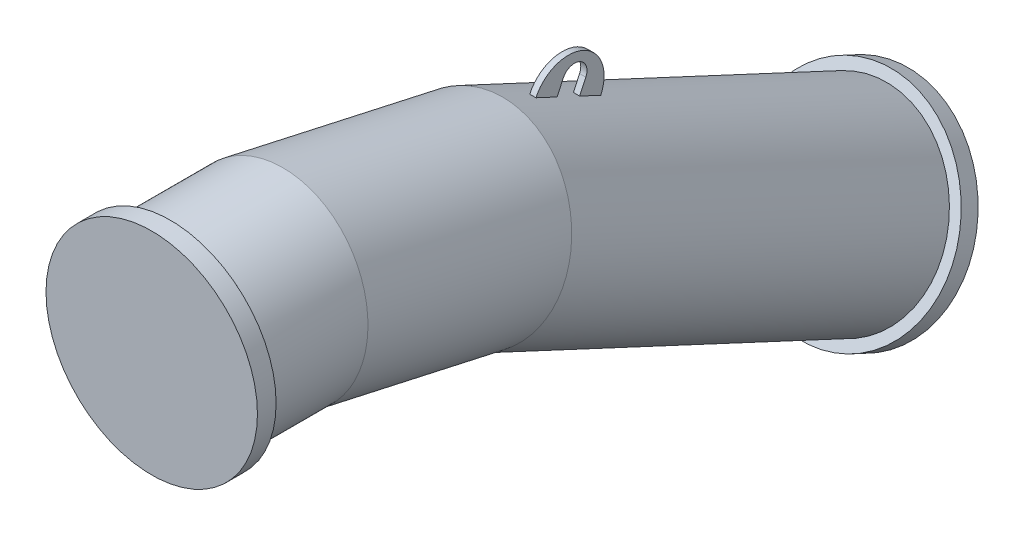
ISO-10303-21;
HEADER;
FILE_DESCRIPTION(('STEP AP214'),'2;1');
FILE_NAME('part.step','',(''),(''),'','','');
FILE_SCHEMA(('AUTOMOTIVE_DESIGN { 1 0 10303 214 1 1 1 1 }'));
ENDSEC;
DATA;
#1=APPLICATION_CONTEXT('core data for automotive mechanical design processes');
#2=APPLICATION_PROTOCOL_DEFINITION('international standard','automotive_design',2000,#1);
#3=PRODUCT_CONTEXT('',#1,'mechanical');
#4=PRODUCT('Part','Part','',(#3));
#5=PRODUCT_RELATED_PRODUCT_CATEGORY('part','',(#4));
#6=PRODUCT_DEFINITION_FORMATION('','',#4);
#7=PRODUCT_DEFINITION_CONTEXT('part definition',#1,'design');
#8=PRODUCT_DEFINITION('design','',#6,#7);
#9=PRODUCT_DEFINITION_SHAPE('','',#8);
#10=(LENGTH_UNIT() NAMED_UNIT(*) SI_UNIT(.MILLI.,.METRE.));
#11=(NAMED_UNIT(*) PLANE_ANGLE_UNIT() SI_UNIT($,.RADIAN.));
#12=(NAMED_UNIT(*) SI_UNIT($,.STERADIAN.) SOLID_ANGLE_UNIT());
#13=UNCERTAINTY_MEASURE_WITH_UNIT(LENGTH_MEASURE(1.E-05),#10,'distance_accuracy_value','');
#14=(GEOMETRIC_REPRESENTATION_CONTEXT(3) GLOBAL_UNCERTAINTY_ASSIGNED_CONTEXT((#13)) GLOBAL_UNIT_ASSIGNED_CONTEXT((#10,
#11,#12)) REPRESENTATION_CONTEXT('',''));
#15=CARTESIAN_POINT('',(0.,0.,0.));
#16=DIRECTION('',(0.,0.,1.));
#17=DIRECTION('',(1.,0.,0.));
#18=AXIS2_PLACEMENT_3D('',#15,#16,#17);
#19=CARTESIAN_POINT('',(0.,-71.1119786402001,-485.042124289447));
#20=DIRECTION('',(0.,0.216439613938103,0.976296007119933));
#21=DIRECTION('',(0.,-0.976296007119933,0.216439613938103));
#22=AXIS2_PLACEMENT_3D('',#19,#20,#21);
#23=CYLINDRICAL_SURFACE('',#22,152.5);
#24=CARTESIAN_POINT('',(0.,-71.1119786402001,-485.042124289447));
#25=DIRECTION('',(0.,-0.321439465303161,-0.946930129495106));
#26=DIRECTION('',(0.,-0.946930129495106,0.321439465303161));
#27=AXIS2_PLACEMENT_3D('',#24,#25,#26);
#28=ELLIPSE('',#27,153.411828018437,152.5);
#29=CARTESIAN_POINT('',(0.,-216.38226081178,-435.72950832002));
#30=VERTEX_POINT('',#29);
#31=EDGE_CURVE('E329',#30,#30,#28,.T.);
#32=ORIENTED_EDGE('',*,*,#31,.F.);
#33=EDGE_LOOP('',(#32));
#34=FACE_BOUND('',#33,.T.);
#35=CARTESIAN_POINT('',(0.,0.,-164.276717524863));
#36=DIRECTION('',(0.,-0.108866874851965,-0.99405633822232));
#37=DIRECTION('',(0.,-0.99405633822232,0.108866874851965));
#38=AXIS2_PLACEMENT_3D('',#35,#36,#37);
#39=ELLIPSE('',#38,153.411828018437,152.5);
#40=CARTESIAN_POINT('',(0.,-152.5,-147.575251243168));
#41=VERTEX_POINT('',#40);
#42=EDGE_CURVE('E10',#41,#41,#39,.T.);
#43=ORIENTED_EDGE('',*,*,#42,.T.);
#44=EDGE_LOOP('',(#43));
#45=FACE_BOUND('',#44,.T.);
#46=ADVANCED_FACE('F17',(#34,#45),#23,.T.);
#47=CARTESIAN_POINT('',(0.,-351.847450315372,-1087.08128612937));
#48=DIRECTION('',(0.,0.422618261740698,0.906307787036651));
#49=DIRECTION('',(0.,-0.906307787036651,0.422618261740698));
#50=AXIS2_PLACEMENT_3D('',#47,#48,#49);
#51=CYLINDRICAL_SURFACE('',#50,152.5);
#52=CARTESIAN_POINT('',(4.99999999999999,2.88206355500217,-687.013127055303));
#53=CARTESIAN_POINT('',(3.33333333333333,2.93158541821618,-687.036262477466));
#54=CARTESIAN_POINT('',(1.66666666666667,2.95634634982318,-687.047830188548));
#55=CARTESIAN_POINT('',(-1.66666666666665,2.95634634982318,-687.047830188548));
#56=CARTESIAN_POINT('',(-3.33333333333331,2.93158541821617,-687.036262477466));
#57=CARTESIAN_POINT('',(-4.99999999999998,2.88206355500216,-687.013127055303));
#58=B_SPLINE_CURVE_WITH_KNOTS('',3,(#52,#53,#54,#55,#56,#57),.UNSPECIFIED.,.F.,.F.,(4,2,4),(0.,
5.00067217892388,10.0013443578478),.UNSPECIFIED.);
#59=CARTESIAN_POINT('',(4.99999999999999,2.88206355500217,-687.013127055303));
#60=VERTEX_POINT('',#59);
#61=CARTESIAN_POINT('',(-5.,2.88206355500202,-687.013127055303));
#62=VERTEX_POINT('',#61);
#63=EDGE_CURVE('E46',#60,#62,#58,.T.);
#64=ORIENTED_EDGE('',*,*,#63,.F.);
#65=DIRECTION('',(0.,0.422618261740698,0.906307787036651));
#66=VECTOR('',#65,1.);
#67=CARTESIAN_POINT('',(5.00000000000004,-213.709820290946,-1151.49592088914));
#68=LINE('',#67,#66);
#69=CARTESIAN_POINT('',(5.00000000000002,18.7302236664366,-653.026638018989));
#70=VERTEX_POINT('',#69);
#71=EDGE_CURVE('E39',#60,#70,#68,.T.);
#72=ORIENTED_EDGE('',*,*,#71,.T.);
#73=CARTESIAN_POINT('',(0.,-119.40740635799,-588.612003259217));
#74=DIRECTION('',(0.,-0.422618261740697,-0.906307787036651));
#75=DIRECTION('',(0.,0.906307787036651,-0.422618261740697));
#76=AXIS2_PLACEMENT_3D('',#73,#74,#75);
#77=CIRCLE('',#76,152.5);
#78=CARTESIAN_POINT('',(-4.99999999999996,18.7302236664361,-653.026638018989));
#79=VERTEX_POINT('',#78);
#80=EDGE_CURVE('E325',#79,#70,#77,.T.);
#81=ORIENTED_EDGE('',*,*,#80,.F.);
#82=DIRECTION('',(0.,0.422618261740698,0.906307787036651));
#83=VECTOR('',#82,1.);
#84=CARTESIAN_POINT('',(-4.99999999999992,-213.709820290946,-1151.49592088914));
#85=LINE('',#84,#83);
#86=EDGE_CURVE('E293',#62,#79,#85,.T.);
#87=ORIENTED_EDGE('',*,*,#86,.F.);
#88=EDGE_LOOP('',(#64,#72,#81,#87));
#89=FACE_BOUND('',#88,.T.);
#90=CARTESIAN_POINT('',(0.,-102.502675888362,-552.359691777751));
#91=DIRECTION('',(0.,0.422618261740698,0.906307787036652));
#92=DIRECTION('',(0.,-0.906307787036651,0.422618261740697));
#93=AXIS2_PLACEMENT_3D('',#90,#91,#92);
#94=CIRCLE('',#93,152.5);
#95=CARTESIAN_POINT('',(5.00000000000002,35.6349541360645,-616.774326537523));
#96=VERTEX_POINT('',#95);
#97=CARTESIAN_POINT('',(-4.99999999999996,35.6349541360641,-616.774326537523));
#98=VERTEX_POINT('',#97);
#99=EDGE_CURVE('E302',#96,#98,#94,.T.);
#100=ORIENTED_EDGE('',*,*,#99,.F.);
#101=CARTESIAN_POINT('',(4.99999999999999,51.4831142474984,-582.787837501208));
#102=VERTEX_POINT('',#101);
#103=EDGE_CURVE('E326',#96,#102,#68,.T.);
#104=ORIENTED_EDGE('',*,*,#103,.T.);
#105=CARTESIAN_POINT('',(-4.99999999999998,51.4831142474984,-582.787837501208));
#106=CARTESIAN_POINT('',(-3.33333333333332,51.5326690491684,-582.810902286625));
#107=CARTESIAN_POINT('',(-1.66666666666666,51.5574464500035,-582.822434679333));
#108=CARTESIAN_POINT('',(1.66666666666666,51.5574464500035,-582.822434679333));
#109=CARTESIAN_POINT('',(3.33333333333333,51.5326690491685,-582.810902286625));
#110=CARTESIAN_POINT('',(4.99999999999999,51.4831142474984,-582.787837501208));
#111=B_SPLINE_CURVE_WITH_KNOTS('',3,(#105,#106,#107,#108,#109,#110),.UNSPECIFIED.,.F.,.F.,(4,2,
4),(0.,5.00067217892388,10.0013443578478),.UNSPECIFIED.);
#112=CARTESIAN_POINT('',(-5.,51.4831142474982,-582.787837501208));
#113=VERTEX_POINT('',#112);
#114=EDGE_CURVE('E292',#113,#102,#111,.T.);
#115=ORIENTED_EDGE('',*,*,#114,.F.);
#116=EDGE_CURVE('E288',#98,#113,#85,.T.);
#117=ORIENTED_EDGE('',*,*,#116,.F.);
#118=EDGE_LOOP('',(#100,#104,#115,#117));
#119=FACE_BOUND('',#118,.T.);
#120=CARTESIAN_POINT('',(0.,-351.847450315372,-1087.08128612937));
#121=DIRECTION('',(0.,-0.422618261740698,-0.906307787036651));
#122=DIRECTION('',(-1.,0.,0.));
#123=AXIS2_PLACEMENT_3D('',#120,#121,#122);
#124=CIRCLE('',#123,152.5);
#125=CARTESIAN_POINT('',(-152.5,-351.847450315372,-1087.08128612937));
#126=VERTEX_POINT('',#125);
#127=EDGE_CURVE('E284',#126,#126,#124,.T.);
#128=ORIENTED_EDGE('',*,*,#127,.F.);
#129=EDGE_LOOP('',(#128));
#130=FACE_BOUND('',#129,.T.);
#131=ORIENTED_EDGE('',*,*,#31,.T.);
#132=EDGE_LOOP('',(#131));
#133=FACE_BOUND('',#132,.T.);
#134=ADVANCED_FACE('F304',(#89,#119,#130,#133),#51,.T.);
#135=CARTESIAN_POINT('',(4.99999999999999,27.2568963999164,-634.935132433942));
#136=DIRECTION('',(-0.999999999999999,0.,0.));
#137=DIRECTION('',(0.,-0.906307787036653,0.422618261740699));
#138=AXIS2_PLACEMENT_3D('',#135,#136,#137);
#139=CYLINDRICAL_SURFACE('',#138,57.5);
#140=CARTESIAN_POINT('',(4.99999999999999,27.2568963999164,-634.935132433942));
#141=DIRECTION('',(0.999999999999999,0.,0.));
#142=DIRECTION('',(0.,0.906307787036653,-0.422618261740699));
#143=AXIS2_PLACEMENT_3D('',#140,#141,#142);
#144=CIRCLE('',#143,57.5);
#145=EDGE_CURVE('E261',#60,#102,#144,.T.);
#146=ORIENTED_EDGE('',*,*,#145,.F.);
#147=ORIENTED_EDGE('',*,*,#63,.T.);
#148=CARTESIAN_POINT('',(-5.,27.2568963999164,-634.935132433942));
#149=DIRECTION('',(0.999999999999999,0.,0.));
#150=DIRECTION('',(0.,0.906307787036653,-0.422618261740699));
#151=AXIS2_PLACEMENT_3D('',#148,#149,#150);
#152=CIRCLE('',#151,57.5);
#153=EDGE_CURVE('E254',#62,#113,#152,.T.);
#154=ORIENTED_EDGE('',*,*,#153,.T.);
#155=ORIENTED_EDGE('',*,*,#114,.T.);
#156=EDGE_LOOP('',(#146,#147,#154,#155));
#157=FACE_BOUND('',#156,.T.);
#158=ADVANCED_FACE('F307',(#157),#139,.T.);
#159=CARTESIAN_POINT('',(5.,48.5551293952778,-644.866661584849));
#160=DIRECTION('',(0.999999999999999,0.,0.));
#161=DIRECTION('',(0.,0.906307787036653,-0.422618261740699));
#162=AXIS2_PLACEMENT_3D('',#159,#160,#161);
#163=PLANE('',#162);
#164=ORIENTED_EDGE('',*,*,#71,.F.);
#165=ORIENTED_EDGE('',*,*,#145,.T.);
#166=ORIENTED_EDGE('',*,*,#103,.F.);
#167=DIRECTION('',(0.,0.906307787036652,-0.422618261740699));
#168=VECTOR('',#167,1.);
#169=CARTESIAN_POINT('',(4.99999999999999,35.7092616347304,-616.808976693209));
#170=LINE('',#169,#168);
#171=CARTESIAN_POINT('',(4.99999999999999,57.0074946300917,-626.740505844115));
#172=VERTEX_POINT('',#171);
#173=EDGE_CURVE('E250',#96,#172,#170,.T.);
#174=ORIENTED_EDGE('',*,*,#173,.T.);
#175=CARTESIAN_POINT('',(5.,48.5551293952778,-644.866661584849));
#176=DIRECTION('',(-0.999999999999999,0.,0.));
#177=DIRECTION('',(0.,0.906307787036653,-0.422618261740699));
#178=AXIS2_PLACEMENT_3D('',#175,#176,#177);
#179=CIRCLE('',#178,20.);
#180=CARTESIAN_POINT('',(4.99999999999999,40.1027641604639,-662.992817325582));
#181=VERTEX_POINT('',#180);
#182=EDGE_CURVE('E253',#172,#181,#179,.T.);
#183=ORIENTED_EDGE('',*,*,#182,.T.);
#184=DIRECTION('',(0.,-0.906307787036653,0.422618261740699));
#185=VECTOR('',#184,1.);
#186=CARTESIAN_POINT('',(5.,18.8045311651025,-653.061288174675));
#187=LINE('',#186,#185);
#188=EDGE_CURVE('E257',#181,#70,#187,.T.);
#189=ORIENTED_EDGE('',*,*,#188,.T.);
#190=EDGE_LOOP('',(#164,#165,#166,#174,#183,#189));
#191=FACE_BOUND('',#190,.T.);
#192=ADVANCED_FACE('F312',(#191),#163,.T.);
#193=CARTESIAN_POINT('',(-4.99999999999999,48.5551293952778,-644.866661584849));
#194=DIRECTION('',(0.999999999999999,0.,0.));
#195=DIRECTION('',(0.,0.906307787036653,-0.422618261740699));
#196=AXIS2_PLACEMENT_3D('',#193,#194,#195);
#197=PLANE('',#196);
#198=ORIENTED_EDGE('',*,*,#153,.F.);
#199=ORIENTED_EDGE('',*,*,#86,.T.);
#200=DIRECTION('',(0.,-0.906307787036653,0.422618261740699));
#201=VECTOR('',#200,1.);
#202=CARTESIAN_POINT('',(-4.99999999999999,18.8045311651025,-653.061288174675));
#203=LINE('',#202,#201);
#204=CARTESIAN_POINT('',(-5.,40.1027641604639,-662.992817325582));
#205=VERTEX_POINT('',#204);
#206=EDGE_CURVE('E271',#205,#79,#203,.T.);
#207=ORIENTED_EDGE('',*,*,#206,.F.);
#208=CARTESIAN_POINT('',(-4.99999999999999,48.5551293952778,-644.866661584849));
#209=DIRECTION('',(-0.999999999999999,0.,0.));
#210=DIRECTION('',(0.,0.906307787036653,-0.422618261740699));
#211=AXIS2_PLACEMENT_3D('',#208,#209,#210);
#212=CIRCLE('',#211,20.);
#213=CARTESIAN_POINT('',(-5.,57.0074946300917,-626.740505844115));
#214=VERTEX_POINT('',#213);
#215=EDGE_CURVE('E268',#214,#205,#212,.T.);
#216=ORIENTED_EDGE('',*,*,#215,.F.);
#217=DIRECTION('',(0.,0.906307787036652,-0.422618261740699));
#218=VECTOR('',#217,1.);
#219=CARTESIAN_POINT('',(-4.99999999999999,35.7092616347304,-616.808976693209));
#220=LINE('',#219,#218);
#221=EDGE_CURVE('E246',#98,#214,#220,.T.);
#222=ORIENTED_EDGE('',*,*,#221,.F.);
#223=ORIENTED_EDGE('',*,*,#116,.T.);
#224=EDGE_LOOP('',(#198,#199,#207,#216,#222,#223));
#225=FACE_BOUND('',#224,.T.);
#226=ADVANCED_FACE('F314',(#225),#197,.F.);
#227=CARTESIAN_POINT('',(4.99999999999999,35.7092616347304,-616.808976693209));
#228=DIRECTION('',(0.,0.422618261740698,0.906307787036652));
#229=DIRECTION('',(0.,-0.906307787036652,0.422618261740699));
#230=AXIS2_PLACEMENT_3D('',#227,#228,#229);
#231=PLANE('',#230);
#232=ORIENTED_EDGE('',*,*,#173,.F.);
#233=ORIENTED_EDGE('',*,*,#99,.T.);
#234=ORIENTED_EDGE('',*,*,#221,.T.);
#235=DIRECTION('',(-0.999999999999999,0.,0.));
#236=VECTOR('',#235,1.);
#237=CARTESIAN_POINT('',(4.99999999999999,57.0074946300917,-626.740505844115));
#238=LINE('',#237,#236);
#239=EDGE_CURVE('E280',#172,#214,#238,.T.);
#240=ORIENTED_EDGE('',*,*,#239,.F.);
#241=EDGE_LOOP('',(#232,#233,#234,#240));
#242=FACE_BOUND('',#241,.T.);
#243=ADVANCED_FACE('F402',(#242),#231,.F.);
#244=CARTESIAN_POINT('',(5.,48.5551293952778,-644.866661584849));
#245=DIRECTION('',(-0.999999999999999,0.,0.));
#246=DIRECTION('',(0.,-0.906307787036653,0.422618261740699));
#247=AXIS2_PLACEMENT_3D('',#244,#245,#246);
#248=CYLINDRICAL_SURFACE('',#247,20.);
#249=ORIENTED_EDGE('',*,*,#215,.T.);
#250=DIRECTION('',(-0.999999999999999,0.,0.));
#251=VECTOR('',#250,1.);
#252=CARTESIAN_POINT('',(4.99999999999999,40.1027641604639,-662.992817325582));
#253=LINE('',#252,#251);
#254=EDGE_CURVE('E265',#181,#205,#253,.T.);
#255=ORIENTED_EDGE('',*,*,#254,.F.);
#256=ORIENTED_EDGE('',*,*,#182,.F.);
#257=ORIENTED_EDGE('',*,*,#239,.T.);
#258=EDGE_LOOP('',(#249,#255,#256,#257));
#259=FACE_BOUND('',#258,.T.);
#260=ADVANCED_FACE('F395',(#259),#248,.F.);
#261=CARTESIAN_POINT('',(5.,18.8045311651025,-653.061288174675));
#262=DIRECTION('',(0.,-0.422618261740697,-0.906307787036651));
#263=DIRECTION('',(0.,0.906307787036653,-0.422618261740699));
#264=AXIS2_PLACEMENT_3D('',#261,#262,#263);
#265=PLANE('',#264);
#266=ORIENTED_EDGE('',*,*,#206,.T.);
#267=ORIENTED_EDGE('',*,*,#80,.T.);
#268=ORIENTED_EDGE('',*,*,#188,.F.);
#269=ORIENTED_EDGE('',*,*,#254,.T.);
#270=EDGE_LOOP('',(#266,#267,#268,#269));
#271=FACE_BOUND('',#270,.T.);
#272=ADVANCED_FACE('F316',(#271),#265,.F.);
#273=CARTESIAN_POINT('',(0.,-351.847450315376,-1087.08128612938));
#274=DIRECTION('',(0.,-0.422618261740704,-0.906307787036656));
#275=DIRECTION('',(-1.,0.,0.));
#276=AXIS2_PLACEMENT_3D('',#273,#274,#275);
#277=CYLINDRICAL_SURFACE('',#276,170.);
#278=CARTESIAN_POINT('',(0.,-351.847450315376,-1087.08128612938));
#279=DIRECTION('',(0.,-0.422618261740704,-0.906307787036656));
#280=DIRECTION('',(-1.,0.,0.));
#281=AXIS2_PLACEMENT_3D('',#278,#279,#280);
#282=CIRCLE('',#281,170.);
#283=CARTESIAN_POINT('',(-170.,-351.847450315376,-1087.08128612938));
#284=VERTEX_POINT('',#283);
#285=EDGE_CURVE('E242',#284,#284,#282,.T.);
#286=ORIENTED_EDGE('',*,*,#285,.T.);
#287=EDGE_LOOP('',(#286));
#288=FACE_BOUND('',#287,.T.);
#289=CARTESIAN_POINT('',(0.,-364.525998167597,-1114.27051974047));
#290=DIRECTION('',(0.,-0.422618261740704,-0.906307787036656));
#291=DIRECTION('',(-1.,0.,0.));
#292=AXIS2_PLACEMENT_3D('',#289,#290,#291);
#293=CIRCLE('',#292,170.);
#294=CARTESIAN_POINT('',(-170.,-364.525998167597,-1114.27051974047));
#295=VERTEX_POINT('',#294);
#296=EDGE_CURVE('E238',#295,#295,#293,.T.);
#297=ORIENTED_EDGE('',*,*,#296,.F.);
#298=EDGE_LOOP('',(#297));
#299=FACE_BOUND('',#298,.T.);
#300=ADVANCED_FACE('F384',(#288,#299),#277,.T.);
#301=CARTESIAN_POINT('',(0.,-351.847450315376,-1087.08128612938));
#302=DIRECTION('',(0.,-0.422618261740704,-0.906307787036656));
#303=DIRECTION('',(-1.,0.,0.));
#304=AXIS2_PLACEMENT_3D('',#301,#302,#303);
#305=PLANE('',#304);
#306=ORIENTED_EDGE('',*,*,#127,.T.);
#307=EDGE_LOOP('',(#306));
#308=FACE_BOUND('',#307,.T.);
#309=ORIENTED_EDGE('',*,*,#285,.F.);
#310=EDGE_LOOP('',(#309));
#311=FACE_BOUND('',#310,.T.);
#312=ADVANCED_FACE('F350',(#308,#311),#305,.F.);
#313=CARTESIAN_POINT('',(0.,-1.67366120962242E-13,0.));
#314=DIRECTION('',(0.,0.,1.00000000000001));
#315=DIRECTION('',(-1.,0.,0.));
#316=AXIS2_PLACEMENT_3D('',#313,#314,#315);
#317=CYLINDRICAL_SURFACE('',#316,170.);
#318=CARTESIAN_POINT('',(0.,-1.67366120962242E-13,0.));
#319=DIRECTION('',(0.,0.,1.00000000000001));
#320=DIRECTION('',(-1.,0.,0.));
#321=AXIS2_PLACEMENT_3D('',#318,#319,#320);
#322=CIRCLE('',#321,170.);
#323=CARTESIAN_POINT('',(-170.,-1.82247305620803E-13,0.));
#324=VERTEX_POINT('',#323);
#325=EDGE_CURVE('E234',#324,#324,#322,.T.);
#326=ORIENTED_EDGE('',*,*,#325,.T.);
#327=EDGE_LOOP('',(#326));
#328=FACE_BOUND('',#327,.T.);
#329=CARTESIAN_POINT('',(0.,0.,30.));
#330=DIRECTION('',(0.,0.,1.00000000000001));
#331=DIRECTION('',(-1.,0.,0.));
#332=AXIS2_PLACEMENT_3D('',#329,#330,#331);
#333=CIRCLE('',#332,170.);
#334=CARTESIAN_POINT('',(-170.,0.,30.));
#335=VERTEX_POINT('',#334);
#336=EDGE_CURVE('E199',#335,#335,#333,.T.);
#337=ORIENTED_EDGE('',*,*,#336,.F.);
#338=EDGE_LOOP('',(#337));
#339=FACE_BOUND('',#338,.T.);
#340=ADVANCED_FACE('F344',(#328,#339),#317,.T.);
#341=CARTESIAN_POINT('',(0.,-1.67366120962242E-13,0.));
#342=DIRECTION('',(0.,0.,1.00000000000001));
#343=DIRECTION('',(-1.,0.,0.));
#344=AXIS2_PLACEMENT_3D('',#341,#342,#343);
#345=PLANE('',#344);
#346=CARTESIAN_POINT('',(0.,0.,0.));
#347=DIRECTION('',(0.,0.,-1.));
#348=DIRECTION('',(-1.,0.,0.));
#349=AXIS2_PLACEMENT_3D('',#346,#347,#348);
#350=CIRCLE('',#349,152.5);
#351=CARTESIAN_POINT('',(-152.5,0.,0.));
#352=VERTEX_POINT('',#351);
#353=EDGE_CURVE('E27',#352,#352,#350,.T.);
#354=ORIENTED_EDGE('',*,*,#353,.F.);
#355=EDGE_LOOP('',(#354));
#356=FACE_BOUND('',#355,.T.);
#357=ORIENTED_EDGE('',*,*,#325,.F.);
#358=EDGE_LOOP('',(#357));
#359=FACE_BOUND('',#358,.T.);
#360=ADVANCED_FACE('F341',(#356,#359),#345,.F.);
#361=CARTESIAN_POINT('',(0.,0.,-164.276717524863));
#362=DIRECTION('',(0.,0.,1.));
#363=DIRECTION('',(1.,0.,0.));
#364=AXIS2_PLACEMENT_3D('',#361,#362,#363);
#365=CYLINDRICAL_SURFACE('',#364,152.5);
#366=ORIENTED_EDGE('',*,*,#353,.T.);
#367=EDGE_LOOP('',(#366));
#368=FACE_BOUND('',#367,.T.);
#369=ORIENTED_EDGE('',*,*,#42,.F.);
#370=EDGE_LOOP('',(#369));
#371=FACE_BOUND('',#370,.T.);
#372=ADVANCED_FACE('F19',(#368,#371),#365,.T.);
#373=CARTESIAN_POINT('',(0.,0.,30.));
#374=DIRECTION('',(0.,0.,1.00000000000001));
#375=DIRECTION('',(-1.,0.,0.));
#376=AXIS2_PLACEMENT_3D('',#373,#374,#375);
#377=PLANE('',#376);
#378=ORIENTED_EDGE('',*,*,#336,.T.);
#379=EDGE_LOOP('',(#378));
#380=FACE_BOUND('',#379,.T.);
#381=ADVANCED_FACE('F354',(#380),#377,.T.);
#382=CARTESIAN_POINT('',(0.,-364.525998167597,-1114.27051974047));
#383=DIRECTION('',(0.,-0.422618261740704,-0.906307787036656));
#384=DIRECTION('',(-1.,0.,0.));
#385=AXIS2_PLACEMENT_3D('',#382,#383,#384);
#386=PLANE('',#385);
#387=ORIENTED_EDGE('',*,*,#296,.T.);
#388=EDGE_LOOP('',(#387));
#389=FACE_BOUND('',#388,.T.);
#390=ADVANCED_FACE('F356',(#389),#386,.T.);
#391=CLOSED_SHELL('',(#46,#134,#158,#192,#226,#243,#260,#272,#300,#312,#340,#360,#372,#381,#390));
#392=CARTESIAN_POINT('',(136.272231045415,-405.117815395634,-1067.75779653455));
#393=DIRECTION('',(0.,-0.422618261740701,-0.906307787036649));
#394=DIRECTION('',(0.,0.906307787036649,-0.422618261740701));
#395=AXIS2_PLACEMENT_3D('',#392,#393,#394);
#396=PLANE('',#395);
#397=CARTESIAN_POINT('',(136.272231045414,-405.117815395634,-1067.75779653455));
#398=DIRECTION('',(0.,-0.422618261740701,-0.906307787036649));
#399=DIRECTION('',(0.,0.906307787036649,-0.422618261740701));
#400=AXIS2_PLACEMENT_3D('',#397,#398,#399);
#401=CIRCLE('',#400,6.253580776475);
#402=CARTESIAN_POINT('',(136.272231045414,-399.450146441052,-1070.40067397196));
#403=VERTEX_POINT('',#402);
#404=EDGE_CURVE('E186',#403,#403,#401,.F.);
#405=ORIENTED_EDGE('',*,*,#404,.T.);
#406=EDGE_LOOP('',(#405));
#407=FACE_BOUND('',#406,.T.);
#408=ADVANCED_FACE('F641',(#407),#396,.F.);
#409=CARTESIAN_POINT('',(136.272231045414,-405.751742788244,-1069.11725821511));
#410=DIRECTION('',(0.,-0.422618261740704,-0.906307787036656));
#411=DIRECTION('',(-1.,0.,0.));
#412=AXIS2_PLACEMENT_3D('',#409,#410,#411);
#413=CONICAL_SURFACE('',#412,8.74999999999999,1.02974425867665);
#414=CARTESIAN_POINT('',(136.272231045414,-403.529814422578,-1064.35231745806));
#415=VERTEX_POINT('',#414);
#416=VERTEX_LOOP('',#415);
#417=FACE_BOUND('',#416,.T.);
#418=ORIENTED_EDGE('',*,*,#404,.F.);
#419=EDGE_LOOP('',(#418));
#420=FACE_BOUND('',#419,.T.);
#421=ADVANCED_FACE('F639',(#417,#420),#413,.F.);
#422=CLOSED_SHELL('',(#408,#421));
#423=CARTESIAN_POINT('',(136.272231045415,-302.803267852526,-1115.46785359457));
#424=DIRECTION('',(0.,-0.422618261740701,-0.906307787036649));
#425=DIRECTION('',(0.,0.906307787036649,-0.422618261740701));
#426=AXIS2_PLACEMENT_3D('',#423,#424,#425);
#427=PLANE('',#426);
#428=CARTESIAN_POINT('',(136.272231045415,-302.803267852526,-1115.46785359457));
#429=DIRECTION('',(0.,-0.422618261740701,-0.906307787036649));
#430=DIRECTION('',(0.,0.906307787036649,-0.422618261740701));
#431=AXIS2_PLACEMENT_3D('',#428,#429,#430);
#432=CIRCLE('',#431,6.25358077647346);
#433=CARTESIAN_POINT('',(136.272231045415,-297.135598897946,-1118.11073103197));
#434=VERTEX_POINT('',#433);
#435=EDGE_CURVE('E177',#434,#434,#432,.F.);
#436=ORIENTED_EDGE('',*,*,#435,.T.);
#437=EDGE_LOOP('',(#436));
#438=FACE_BOUND('',#437,.T.);
#439=ADVANCED_FACE('F475',(#438),#427,.F.);
#440=CARTESIAN_POINT('',(136.272231045415,-303.437195245137,-1116.82731527512));
#441=DIRECTION('',(0.,-0.422618261740704,-0.906307787036656));
#442=DIRECTION('',(-1.,0.,0.));
#443=AXIS2_PLACEMENT_3D('',#440,#441,#442);
#444=CONICAL_SURFACE('',#443,8.74999999999999,1.02974425867665);
#445=CARTESIAN_POINT('',(136.272231045415,-301.215266879471,-1112.06237451807));
#446=VERTEX_POINT('',#445);
#447=VERTEX_LOOP('',#446);
#448=FACE_BOUND('',#447,.T.);
#449=ORIENTED_EDGE('',*,*,#435,.F.);
#450=EDGE_LOOP('',(#449));
#451=FACE_BOUND('',#450,.T.);
#452=ADVANCED_FACE('F479',(#448,#451),#444,.F.);
#453=CLOSED_SHELL('',(#439,#452));
#454=CARTESIAN_POINT('',(56.4458062738499,-477.465125777398,-1034.02169165662));
#455=DIRECTION('',(0.,-0.422618261740701,-0.906307787036649));
#456=DIRECTION('',(0.,0.906307787036649,-0.422618261740701));
#457=AXIS2_PLACEMENT_3D('',#454,#455,#456);
#458=PLANE('',#457);
#459=CARTESIAN_POINT('',(56.4458062738499,-477.465125777398,-1034.02169165662));
#460=DIRECTION('',(0.,-0.422618261740701,-0.906307787036649));
#461=DIRECTION('',(0.,0.906307787036649,-0.422618261740701));
#462=AXIS2_PLACEMENT_3D('',#459,#460,#461);
#463=CIRCLE('',#462,6.25358077647483);
#464=CARTESIAN_POINT('',(56.4458062738499,-471.797456822816,-1036.66456909403));
#465=VERTEX_POINT('',#464);
#466=EDGE_CURVE('E164',#465,#465,#463,.F.);
#467=ORIENTED_EDGE('',*,*,#466,.T.);
#468=EDGE_LOOP('',(#467));
#469=FACE_BOUND('',#468,.T.);
#470=ADVANCED_FACE('F556',(#469),#458,.F.);
#471=CARTESIAN_POINT('',(56.4458062738499,-478.099053170009,-1035.38115333717));
#472=DIRECTION('',(0.,-0.422618261740704,-0.906307787036656));
#473=DIRECTION('',(-1.,0.,0.));
#474=AXIS2_PLACEMENT_3D('',#471,#472,#473);
#475=CONICAL_SURFACE('',#474,8.75000000000001,1.02974425867665);
#476=CARTESIAN_POINT('',(56.4458062738499,-475.877124804343,-1030.61621258012));
#477=VERTEX_POINT('',#476);
#478=VERTEX_LOOP('',#477);
#479=FACE_BOUND('',#478,.T.);
#480=ORIENTED_EDGE('',*,*,#466,.F.);
#481=EDGE_LOOP('',(#480));
#482=FACE_BOUND('',#481,.T.);
#483=ADVANCED_FACE('F558',(#479,#482),#475,.F.);
#484=CLOSED_SHELL('',(#470,#483));
#485=CARTESIAN_POINT('',(-56.4458062738518,-477.465125777397,-1034.02169165662));
#486=DIRECTION('',(0.,-0.422618261740701,-0.906307787036649));
#487=DIRECTION('',(0.,0.906307787036649,-0.422618261740701));
#488=AXIS2_PLACEMENT_3D('',#485,#486,#487);
#489=PLANE('',#488);
#490=CARTESIAN_POINT('',(-56.4458062738518,-477.465125777397,-1034.02169165662));
#491=DIRECTION('',(0.,-0.422618261740701,-0.906307787036649));
#492=DIRECTION('',(0.,0.906307787036649,-0.422618261740701));
#493=AXIS2_PLACEMENT_3D('',#490,#491,#492);
#494=CIRCLE('',#493,6.25358077647433);
#495=CARTESIAN_POINT('',(-56.4458062738518,-471.797456822816,-1036.66456909403));
#496=VERTEX_POINT('',#495);
#497=EDGE_CURVE('E160',#496,#496,#494,.F.);
#498=ORIENTED_EDGE('',*,*,#497,.T.);
#499=EDGE_LOOP('',(#498));
#500=FACE_BOUND('',#499,.T.);
#501=ADVANCED_FACE('F154',(#500),#489,.F.);
#502=CARTESIAN_POINT('',(-56.4458062738518,-478.099053170008,-1035.38115333717));
#503=DIRECTION('',(0.,-0.422618261740704,-0.906307787036656));
#504=DIRECTION('',(-1.,0.,0.));
#505=AXIS2_PLACEMENT_3D('',#502,#503,#504);
#506=CONICAL_SURFACE('',#505,8.75000000000001,1.02974425867665);
#507=CARTESIAN_POINT('',(-56.4458062738518,-475.877124804342,-1030.61621258012));
#508=VERTEX_POINT('',#507);
#509=VERTEX_LOOP('',#508);
#510=FACE_BOUND('',#509,.T.);
#511=ORIENTED_EDGE('',*,*,#497,.F.);
#512=EDGE_LOOP('',(#511));
#513=FACE_BOUND('',#512,.T.);
#514=ADVANCED_FACE('F151',(#510,#513),#506,.F.);
#515=CLOSED_SHELL('',(#501,#514));
#516=CARTESIAN_POINT('',(-136.272231045415,-405.117815395632,-1067.75779653455));
#517=DIRECTION('',(0.,-0.422618261740701,-0.906307787036649));
#518=DIRECTION('',(0.,0.906307787036649,-0.422618261740701));
#519=AXIS2_PLACEMENT_3D('',#516,#517,#518);
#520=PLANE('',#519);
#521=CARTESIAN_POINT('',(-136.272231045415,-405.117815395632,-1067.75779653455));
#522=DIRECTION('',(0.,-0.422618261740701,-0.906307787036649));
#523=DIRECTION('',(0.,0.906307787036649,-0.422618261740701));
#524=AXIS2_PLACEMENT_3D('',#521,#522,#523);
#525=CIRCLE('',#524,6.2535807764751);
#526=CARTESIAN_POINT('',(-136.272231045415,-399.45014644105,-1070.40067397196));
#527=VERTEX_POINT('',#526);
#528=EDGE_CURVE('E195',#527,#527,#525,.F.);
#529=ORIENTED_EDGE('',*,*,#528,.T.);
#530=EDGE_LOOP('',(#529));
#531=FACE_BOUND('',#530,.T.);
#532=ADVANCED_FACE('F588',(#531),#520,.F.);
#533=CARTESIAN_POINT('',(-136.272231045415,-405.751742788243,-1069.11725821511));
#534=DIRECTION('',(0.,-0.422618261740704,-0.906307787036656));
#535=DIRECTION('',(-1.,0.,0.));
#536=AXIS2_PLACEMENT_3D('',#533,#534,#535);
#537=CONICAL_SURFACE('',#536,8.74999999999999,1.02974425867665);
#538=CARTESIAN_POINT('',(-136.272231045415,-403.529814422577,-1064.35231745806));
#539=VERTEX_POINT('',#538);
#540=VERTEX_LOOP('',#539);
#541=FACE_BOUND('',#540,.T.);
#542=ORIENTED_EDGE('',*,*,#528,.F.);
#543=EDGE_LOOP('',(#542));
#544=FACE_BOUND('',#543,.T.);
#545=ADVANCED_FACE('F592',(#541,#544),#537,.F.);
#546=CLOSED_SHELL('',(#532,#545));
#547=CARTESIAN_POINT('',(56.4458062738508,-230.455957470762,-1149.2039584725));
#548=DIRECTION('',(0.,-0.422618261740701,-0.906307787036649));
#549=DIRECTION('',(0.,0.906307787036649,-0.422618261740701));
#550=AXIS2_PLACEMENT_3D('',#547,#548,#549);
#551=PLANE('',#550);
#552=CARTESIAN_POINT('',(56.4458062738508,-230.455957470762,-1149.2039584725));
#553=DIRECTION('',(0.,-0.422618261740701,-0.906307787036649));
#554=DIRECTION('',(0.,0.906307787036649,-0.422618261740701));
#555=AXIS2_PLACEMENT_3D('',#552,#553,#554);
#556=CIRCLE('',#555,6.25358077647396);
#557=CARTESIAN_POINT('',(56.4458062738508,-224.788288516181,-1151.84683590991));
#558=VERTEX_POINT('',#557);
#559=EDGE_CURVE('E193',#558,#558,#556,.F.);
#560=ORIENTED_EDGE('',*,*,#559,.T.);
#561=EDGE_LOOP('',(#560));
#562=FACE_BOUND('',#561,.T.);
#563=ADVANCED_FACE('F609',(#562),#551,.F.);
#564=CARTESIAN_POINT('',(56.4458062738508,-231.089884863373,-1150.56342015305));
#565=DIRECTION('',(0.,-0.422618261740704,-0.906307787036656));
#566=DIRECTION('',(-1.,0.,0.));
#567=AXIS2_PLACEMENT_3D('',#564,#565,#566);
#568=CONICAL_SURFACE('',#567,8.75000000000001,1.02974425867665);
#569=CARTESIAN_POINT('',(56.4458062738509,-228.867956497707,-1145.79847939601));
#570=VERTEX_POINT('',#569);
#571=VERTEX_LOOP('',#570);
#572=FACE_BOUND('',#571,.T.);
#573=ORIENTED_EDGE('',*,*,#559,.F.);
#574=EDGE_LOOP('',(#573));
#575=FACE_BOUND('',#574,.T.);
#576=ADVANCED_FACE('F613',(#572,#575),#568,.F.);
#577=CLOSED_SHELL('',(#563,#576));
#578=CARTESIAN_POINT('',(-56.445806273849,-230.455957470761,-1149.2039584725));
#579=DIRECTION('',(0.,-0.422618261740701,-0.906307787036649));
#580=DIRECTION('',(0.,0.906307787036649,-0.422618261740701));
#581=AXIS2_PLACEMENT_3D('',#578,#579,#580);
#582=PLANE('',#581);
#583=CARTESIAN_POINT('',(-56.445806273849,-230.455957470761,-1149.2039584725));
#584=DIRECTION('',(0.,-0.422618261740701,-0.906307787036649));
#585=DIRECTION('',(0.,0.906307787036649,-0.422618261740701));
#586=AXIS2_PLACEMENT_3D('',#583,#584,#585);
#587=CIRCLE('',#586,6.25358077647424);
#588=CARTESIAN_POINT('',(-56.445806273849,-224.78828851618,-1151.84683590991));
#589=VERTEX_POINT('',#588);
#590=EDGE_CURVE('E173',#589,#589,#587,.F.);
#591=ORIENTED_EDGE('',*,*,#590,.T.);
#592=EDGE_LOOP('',(#591));
#593=FACE_BOUND('',#592,.T.);
#594=ADVANCED_FACE('F463',(#593),#582,.F.);
#595=CARTESIAN_POINT('',(-56.445806273849,-231.089884863372,-1150.56342015305));
#596=DIRECTION('',(0.,-0.422618261740704,-0.906307787036656));
#597=DIRECTION('',(-1.,0.,0.));
#598=AXIS2_PLACEMENT_3D('',#595,#596,#597);
#599=CONICAL_SURFACE('',#598,8.75000000000001,1.02974425867665);
#600=CARTESIAN_POINT('',(-56.4458062738489,-228.867956497706,-1145.79847939601));
#601=VERTEX_POINT('',#600);
#602=VERTEX_LOOP('',#601);
#603=FACE_BOUND('',#602,.T.);
#604=ORIENTED_EDGE('',*,*,#590,.F.);
#605=EDGE_LOOP('',(#604));
#606=FACE_BOUND('',#605,.T.);
#607=ADVANCED_FACE('F458',(#603,#606),#599,.F.);
#608=CLOSED_SHELL('',(#594,#607));
#609=CARTESIAN_POINT('',(-136.272231045414,-302.803267852525,-1115.46785359457));
#610=DIRECTION('',(0.,-0.422618261740701,-0.906307787036649));
#611=DIRECTION('',(0.,0.906307787036649,-0.422618261740701));
#612=AXIS2_PLACEMENT_3D('',#609,#610,#611);
#613=PLANE('',#612);
#614=CARTESIAN_POINT('',(-136.272231045414,-302.803267852525,-1115.46785359457));
#615=DIRECTION('',(0.,-0.422618261740701,-0.906307787036649));
#616=DIRECTION('',(0.,0.906307787036649,-0.422618261740701));
#617=AXIS2_PLACEMENT_3D('',#614,#615,#616);
#618=CIRCLE('',#617,6.25358077647351);
#619=CARTESIAN_POINT('',(-136.272231045414,-297.135598897944,-1118.11073103197));
#620=VERTEX_POINT('',#619);
#621=EDGE_CURVE('E163',#620,#620,#618,.F.);
#622=ORIENTED_EDGE('',*,*,#621,.T.);
#623=EDGE_LOOP('',(#622));
#624=FACE_BOUND('',#623,.T.);
#625=ADVANCED_FACE('F507',(#624),#613,.F.);
#626=CARTESIAN_POINT('',(-136.272231045414,-303.437195245136,-1116.82731527512));
#627=DIRECTION('',(0.,-0.422618261740704,-0.906307787036656));
#628=DIRECTION('',(-1.,0.,0.));
#629=AXIS2_PLACEMENT_3D('',#626,#627,#628);
#630=CONICAL_SURFACE('',#629,8.75,1.02974425867665);
#631=CARTESIAN_POINT('',(-136.272231045414,-301.21526687947,-1112.06237451807));
#632=VERTEX_POINT('',#631);
#633=VERTEX_LOOP('',#632);
#634=FACE_BOUND('',#633,.T.);
#635=ORIENTED_EDGE('',*,*,#621,.F.);
#636=EDGE_LOOP('',(#635));
#637=FACE_BOUND('',#636,.T.);
#638=ADVANCED_FACE('F510',(#634,#637),#630,.F.);
#639=CLOSED_SHELL('',(#625,#638));
#640=CARTESIAN_POINT('',(-136.272231045415,56.4458062738497,4.99999999999998));
#641=DIRECTION('',(0.,0.,1.));
#642=DIRECTION('',(1.,0.,0.));
#643=AXIS2_PLACEMENT_3D('',#640,#641,#642);
#644=PLANE('',#643);
#645=CARTESIAN_POINT('',(-136.272231045415,56.4458062738502,4.99999999999998));
#646=DIRECTION('',(0.,0.,1.));
#647=DIRECTION('',(1.,0.,0.));
#648=AXIS2_PLACEMENT_3D('',#645,#646,#647);
#649=CIRCLE('',#648,6.25358077647479);
#650=CARTESIAN_POINT('',(-130.018650268941,56.4458062738502,4.99999999999998));
#651=VERTEX_POINT('',#650);
#652=EDGE_CURVE('E216',#651,#651,#649,.F.);
#653=ORIENTED_EDGE('',*,*,#652,.T.);
#654=EDGE_LOOP('',(#653));
#655=FACE_BOUND('',#654,.T.);
#656=ADVANCED_FACE('F934',(#655),#644,.F.);
#657=CARTESIAN_POINT('',(-136.272231045415,56.4458062738502,6.49999999999968));
#658=DIRECTION('',(0.,0.,1.00000000000001));
#659=DIRECTION('',(-1.,0.,0.));
#660=AXIS2_PLACEMENT_3D('',#657,#658,#659);
#661=CONICAL_SURFACE('',#660,8.74999999999999,1.02974425867665);
#662=CARTESIAN_POINT('',(-136.272231045415,56.4458062738499,1.24246958350932));
#663=VERTEX_POINT('',#662);
#664=VERTEX_LOOP('',#663);
#665=FACE_BOUND('',#664,.T.);
#666=ORIENTED_EDGE('',*,*,#652,.F.);
#667=EDGE_LOOP('',(#666));
#668=FACE_BOUND('',#667,.T.);
#669=ADVANCED_FACE('F938',(#665,#668),#661,.F.);
#670=CLOSED_SHELL('',(#656,#669));
#671=CARTESIAN_POINT('',(-136.272231045414,-56.4458062738527,4.99999999999998));
#672=DIRECTION('',(0.,0.,1.));
#673=DIRECTION('',(1.,0.,0.));
#674=AXIS2_PLACEMENT_3D('',#671,#672,#673);
#675=PLANE('',#674);
#676=CARTESIAN_POINT('',(-136.272231045414,-56.4458062738528,4.99999999999998));
#677=DIRECTION('',(0.,0.,1.));
#678=DIRECTION('',(1.,0.,0.));
#679=AXIS2_PLACEMENT_3D('',#676,#677,#678);
#680=CIRCLE('',#679,6.25358077647332);
#681=CARTESIAN_POINT('',(-130.018650268941,-56.4458062738528,4.99999999999998));
#682=VERTEX_POINT('',#681);
#683=EDGE_CURVE('E212',#682,#682,#680,.F.);
#684=ORIENTED_EDGE('',*,*,#683,.T.);
#685=EDGE_LOOP('',(#684));
#686=FACE_BOUND('',#685,.T.);
#687=ADVANCED_FACE('F957',(#686),#675,.F.);
#688=CARTESIAN_POINT('',(-136.272231045414,-56.4458062738528,6.50000000000056));
#689=DIRECTION('',(0.,0.,1.00000000000001));
#690=DIRECTION('',(-1.,0.,0.));
#691=AXIS2_PLACEMENT_3D('',#688,#689,#690);
#692=CONICAL_SURFACE('',#691,8.75,1.02974425867665);
#693=CARTESIAN_POINT('',(-136.272231045414,-56.4458062738529,1.24246958350955));
#694=VERTEX_POINT('',#693);
#695=VERTEX_LOOP('',#694);
#696=FACE_BOUND('',#695,.T.);
#697=ORIENTED_EDGE('',*,*,#683,.F.);
#698=EDGE_LOOP('',(#697));
#699=FACE_BOUND('',#698,.T.);
#700=ADVANCED_FACE('F961',(#696,#699),#692,.F.);
#701=CLOSED_SHELL('',(#687,#700));
#702=CARTESIAN_POINT('',(-56.4458062738518,136.272231045416,4.99999999999998));
#703=DIRECTION('',(0.,0.,1.));
#704=DIRECTION('',(1.,0.,0.));
#705=AXIS2_PLACEMENT_3D('',#702,#703,#704);
#706=PLANE('',#705);
#707=CARTESIAN_POINT('',(-56.4458062738518,136.272231045415,4.99999999999998));
#708=DIRECTION('',(0.,0.,1.));
#709=DIRECTION('',(1.,0.,0.));
#710=AXIS2_PLACEMENT_3D('',#707,#708,#709);
#711=CIRCLE('',#710,6.25358077647407);
#712=CARTESIAN_POINT('',(-50.1922254973777,136.272231045415,4.99999999999998));
#713=VERTEX_POINT('',#712);
#714=EDGE_CURVE('E208',#713,#713,#711,.F.);
#715=ORIENTED_EDGE('',*,*,#714,.T.);
#716=EDGE_LOOP('',(#715));
#717=FACE_BOUND('',#716,.T.);
#718=ADVANCED_FACE('F980',(#717),#706,.F.);
#719=CARTESIAN_POINT('',(-56.4458062738518,136.272231045415,6.50000000000012));
#720=DIRECTION('',(0.,0.,1.00000000000001));
#721=DIRECTION('',(-1.,0.,0.));
#722=AXIS2_PLACEMENT_3D('',#719,#720,#721);
#723=CONICAL_SURFACE('',#722,8.75000000000001,1.02974425867665);
#724=CARTESIAN_POINT('',(-56.4458062738518,136.272231045415,1.24246958350888));
#725=VERTEX_POINT('',#724);
#726=VERTEX_LOOP('',#725);
#727=FACE_BOUND('',#726,.T.);
#728=ORIENTED_EDGE('',*,*,#714,.F.);
#729=EDGE_LOOP('',(#728));
#730=FACE_BOUND('',#729,.T.);
#731=ADVANCED_FACE('F984',(#727,#730),#723,.F.);
#732=CLOSED_SHELL('',(#718,#731));
#733=CARTESIAN_POINT('',(56.4458062738499,136.272231045416,4.99999999999998));
#734=DIRECTION('',(0.,0.,1.));
#735=DIRECTION('',(1.,0.,0.));
#736=AXIS2_PLACEMENT_3D('',#733,#734,#735);
#737=PLANE('',#736);
#738=CARTESIAN_POINT('',(56.4458062738499,136.272231045416,4.99999999999998));
#739=DIRECTION('',(0.,0.,1.));
#740=DIRECTION('',(1.,0.,0.));
#741=AXIS2_PLACEMENT_3D('',#738,#739,#740);
#742=CIRCLE('',#741,6.25358077647481);
#743=CARTESIAN_POINT('',(62.6993870503247,136.272231045416,4.99999999999998));
#744=VERTEX_POINT('',#743);
#745=EDGE_CURVE('E203',#744,#744,#742,.F.);
#746=ORIENTED_EDGE('',*,*,#745,.T.);
#747=EDGE_LOOP('',(#746));
#748=FACE_BOUND('',#747,.T.);
#749=ADVANCED_FACE('F715',(#748),#737,.F.);
#750=CARTESIAN_POINT('',(56.4458062738499,136.272231045416,6.49999999999967));
#751=DIRECTION('',(0.,0.,1.00000000000001));
#752=DIRECTION('',(-1.,0.,0.));
#753=AXIS2_PLACEMENT_3D('',#750,#751,#752);
#754=CONICAL_SURFACE('',#753,8.75000000000001,1.02974425867665);
#755=CARTESIAN_POINT('',(56.4458062738499,136.272231045416,1.24246958350932));
#756=VERTEX_POINT('',#755);
#757=VERTEX_LOOP('',#756);
#758=FACE_BOUND('',#757,.T.);
#759=ORIENTED_EDGE('',*,*,#745,.F.);
#760=EDGE_LOOP('',(#759));
#761=FACE_BOUND('',#760,.T.);
#762=ADVANCED_FACE('F713',(#758,#761),#754,.F.);
#763=CLOSED_SHELL('',(#749,#762));
#764=CARTESIAN_POINT('',(136.272231045415,56.4458062738516,4.99999999999998));
#765=DIRECTION('',(0.,0.,1.));
#766=DIRECTION('',(1.,0.,0.));
#767=AXIS2_PLACEMENT_3D('',#764,#765,#766);
#768=PLANE('',#767);
#769=CARTESIAN_POINT('',(136.272231045414,56.4458062738517,4.99999999999998));
#770=DIRECTION('',(0.,0.,1.));
#771=DIRECTION('',(1.,0.,0.));
#772=AXIS2_PLACEMENT_3D('',#769,#770,#771);
#773=CIRCLE('',#772,6.25358077647479);
#774=CARTESIAN_POINT('',(142.525811821889,56.4458062738517,4.99999999999998));
#775=VERTEX_POINT('',#774);
#776=EDGE_CURVE('E207',#775,#775,#773,.F.);
#777=ORIENTED_EDGE('',*,*,#776,.T.);
#778=EDGE_LOOP('',(#777));
#779=FACE_BOUND('',#778,.T.);
#780=ADVANCED_FACE('F435',(#779),#768,.F.);
#781=CARTESIAN_POINT('',(136.272231045414,56.4458062738517,6.49999999999968));
#782=DIRECTION('',(0.,0.,1.00000000000001));
#783=DIRECTION('',(-1.,0.,0.));
#784=AXIS2_PLACEMENT_3D('',#781,#782,#783);
#785=CONICAL_SURFACE('',#784,8.74999999999999,1.02974425867665);
#786=CARTESIAN_POINT('',(136.272231045414,56.4458062738517,1.24246958350932));
#787=VERTEX_POINT('',#786);
#788=VERTEX_LOOP('',#787);
#789=FACE_BOUND('',#788,.T.);
#790=ORIENTED_EDGE('',*,*,#776,.F.);
#791=EDGE_LOOP('',(#790));
#792=FACE_BOUND('',#791,.T.);
#793=ADVANCED_FACE('F439',(#789,#792),#785,.F.);
#794=CLOSED_SHELL('',(#780,#793));
#795=CARTESIAN_POINT('',(136.272231045415,-56.4458062738509,4.99999999999998));
#796=DIRECTION('',(0.,0.,1.));
#797=DIRECTION('',(1.,0.,0.));
#798=AXIS2_PLACEMENT_3D('',#795,#796,#797);
#799=PLANE('',#798);
#800=CARTESIAN_POINT('',(136.272231045415,-56.4458062738512,4.99999999999998));
#801=DIRECTION('',(0.,0.,1.));
#802=DIRECTION('',(1.,0.,0.));
#803=AXIS2_PLACEMENT_3D('',#800,#801,#802);
#804=CIRCLE('',#803,6.25358077647332);
#805=CARTESIAN_POINT('',(142.525811821888,-56.4458062738512,4.99999999999998));
#806=VERTEX_POINT('',#805);
#807=EDGE_CURVE('E227',#806,#806,#804,.F.);
#808=ORIENTED_EDGE('',*,*,#807,.T.);
#809=EDGE_LOOP('',(#808));
#810=FACE_BOUND('',#809,.T.);
#811=ADVANCED_FACE('F1029',(#810),#799,.F.);
#812=CARTESIAN_POINT('',(136.272231045415,-56.4458062738512,6.50000000000056));
#813=DIRECTION('',(0.,0.,1.00000000000001));
#814=DIRECTION('',(-1.,0.,0.));
#815=AXIS2_PLACEMENT_3D('',#812,#813,#814);
#816=CONICAL_SURFACE('',#815,8.74999999999999,1.02974425867665);
#817=CARTESIAN_POINT('',(136.272231045415,-56.4458062738508,1.24246958350866));
#818=VERTEX_POINT('',#817);
#819=VERTEX_LOOP('',#818);
#820=FACE_BOUND('',#819,.T.);
#821=ORIENTED_EDGE('',*,*,#807,.F.);
#822=EDGE_LOOP('',(#821));
#823=FACE_BOUND('',#822,.T.);
#824=ADVANCED_FACE('F1033',(#820,#823),#816,.F.);
#825=CLOSED_SHELL('',(#811,#824));
#826=CARTESIAN_POINT('',(56.4458062738509,-136.272231045416,4.99999999999998));
#827=DIRECTION('',(0.,0.,1.));
#828=DIRECTION('',(1.,0.,0.));
#829=AXIS2_PLACEMENT_3D('',#826,#827,#828);
#830=PLANE('',#829);
#831=CARTESIAN_POINT('',(56.4458062738509,-136.272231045416,4.99999999999998));
#832=DIRECTION('',(0.,0.,1.));
#833=DIRECTION('',(1.,0.,0.));
#834=AXIS2_PLACEMENT_3D('',#831,#832,#833);
#835=CIRCLE('',#834,6.25358077647369);
#836=CARTESIAN_POINT('',(62.6993870503245,-136.272231045416,4.99999999999998));
#837=VERTEX_POINT('',#836);
#838=EDGE_CURVE('E223',#837,#837,#835,.F.);
#839=ORIENTED_EDGE('',*,*,#838,.T.);
#840=EDGE_LOOP('',(#839));
#841=FACE_BOUND('',#840,.T.);
#842=ADVANCED_FACE('F1054',(#841),#830,.F.);
#843=CARTESIAN_POINT('',(56.4458062738509,-136.272231045416,6.50000000000035));
#844=DIRECTION('',(0.,0.,1.00000000000001));
#845=DIRECTION('',(-1.,0.,0.));
#846=AXIS2_PLACEMENT_3D('',#843,#844,#845);
#847=CONICAL_SURFACE('',#846,8.75000000000001,1.02974425867665);
#848=CARTESIAN_POINT('',(56.4458062738509,-136.272231045416,1.24246958350911));
#849=VERTEX_POINT('',#848);
#850=VERTEX_LOOP('',#849);
#851=FACE_BOUND('',#850,.T.);
#852=ORIENTED_EDGE('',*,*,#838,.F.);
#853=EDGE_LOOP('',(#852));
#854=FACE_BOUND('',#853,.T.);
#855=ADVANCED_FACE('F1058',(#851,#854),#847,.F.);
#856=CLOSED_SHELL('',(#842,#855));
#857=CARTESIAN_POINT('',(-56.445806273849,-136.272231045417,4.99999999999998));
#858=DIRECTION('',(0.,0.,1.));
#859=DIRECTION('',(1.,0.,0.));
#860=AXIS2_PLACEMENT_3D('',#857,#858,#859);
#861=PLANE('',#860);
#862=CARTESIAN_POINT('',(-56.445806273849,-136.272231045417,4.99999999999998));
#863=DIRECTION('',(0.,0.,1.));
#864=DIRECTION('',(1.,0.,0.));
#865=AXIS2_PLACEMENT_3D('',#862,#863,#864);
#866=CIRCLE('',#865,6.25358077647406);
#867=CARTESIAN_POINT('',(-50.1922254973749,-136.272231045417,4.99999999999998));
#868=VERTEX_POINT('',#867);
#869=EDGE_CURVE('E190',#868,#868,#866,.F.);
#870=ORIENTED_EDGE('',*,*,#869,.T.);
#871=EDGE_LOOP('',(#870));
#872=FACE_BOUND('',#871,.T.);
#873=ADVANCED_FACE('F1079',(#872),#861,.F.);
#874=CARTESIAN_POINT('',(-56.445806273849,-136.272231045417,6.50000000000012));
#875=DIRECTION('',(0.,0.,1.00000000000001));
#876=DIRECTION('',(-1.,0.,0.));
#877=AXIS2_PLACEMENT_3D('',#874,#875,#876);
#878=CONICAL_SURFACE('',#877,8.75000000000001,1.02974425867665);
#879=CARTESIAN_POINT('',(-56.4458062738489,-136.272231045416,1.24246958350888));
#880=VERTEX_POINT('',#879);
#881=VERTEX_LOOP('',#880);
#882=FACE_BOUND('',#881,.T.);
#883=ORIENTED_EDGE('',*,*,#869,.F.);
#884=EDGE_LOOP('',(#883));
#885=FACE_BOUND('',#884,.T.);
#886=ADVANCED_FACE('F1083',(#882,#885),#878,.F.);
#887=CLOSED_SHELL('',(#873,#886));
#888=CARTESIAN_POINT('',(0.,-353.96054162408,-1091.61282506456));
#889=DIRECTION('',(0.,-0.422618261740701,-0.906307787036649));
#890=DIRECTION('',(0.,0.906307787036649,-0.422618261740701));
#891=AXIS2_PLACEMENT_3D('',#888,#889,#890);
#892=PLANE('',#891);
#893=CARTESIAN_POINT('',(0.,-353.96054162408,-1091.61282506456));
#894=DIRECTION('',(0.,-0.422618261740701,-0.906307787036649));
#895=DIRECTION('',(0.,0.906307787036649,-0.422618261740701));
#896=AXIS2_PLACEMENT_3D('',#893,#894,#895);
#897=CIRCLE('',#896,101.5);
#898=CARTESIAN_POINT('',(0.,-261.97030123986,-1134.50857863124));
#899=VERTEX_POINT('',#898);
#900=EDGE_CURVE('E180',#899,#899,#897,.F.);
#901=ORIENTED_EDGE('',*,*,#900,.T.);
#902=EDGE_LOOP('',(#901));
#903=FACE_BOUND('',#902,.T.);
#904=ADVANCED_FACE('F747',(#903),#892,.F.);
#905=CARTESIAN_POINT('',(0.,-1.67366120962242E-13,0.));
#906=DIRECTION('',(0.,0.,1.00000000000001));
#907=DIRECTION('',(-1.,0.,0.));
#908=AXIS2_PLACEMENT_3D('',#905,#906,#907);
#909=PLANE('',#908);
#910=CARTESIAN_POINT('',(0.,-1.67366120962242E-13,0.));
#911=DIRECTION('',(0.,0.,1.00000000000001));
#912=DIRECTION('',(-1.,0.,0.));
#913=AXIS2_PLACEMENT_3D('',#910,#911,#912);
#914=CIRCLE('',#913,101.5);
#915=CARTESIAN_POINT('',(-101.5,-1.76251063567207E-13,0.));
#916=VERTEX_POINT('',#915);
#917=EDGE_CURVE('E546',#916,#916,#914,.T.);
#918=ORIENTED_EDGE('',*,*,#917,.T.);
#919=EDGE_LOOP('',(#918));
#920=FACE_BOUND('',#919,.T.);
#921=CARTESIAN_POINT('',(0.,0.,0.));
#922=DIRECTION('',(0.,0.,-1.));
#923=DIRECTION('',(0.,1.,0.));
#924=AXIS2_PLACEMENT_3D('',#921,#922,#923);
#925=CIRCLE('',#924,101.6);
#926=CARTESIAN_POINT('',(0.,101.599999999999,0.));
#927=VERTEX_POINT('',#926);
#928=EDGE_CURVE('E782',#927,#927,#925,.T.);
#929=ORIENTED_EDGE('',*,*,#928,.T.);
#930=EDGE_LOOP('',(#929));
#931=FACE_BOUND('',#930,.T.);
#932=ADVANCED_FACE('F701',(#920,#931),#909,.F.);
#933=CARTESIAN_POINT('',(0.,-1500.,0.));
#934=DIRECTION('',(-1.,0.,0.));
#935=DIRECTION('',(0.,0.,1.));
#936=AXIS2_PLACEMENT_3D('',#933,#934,#935);
#937=TOROIDAL_SURFACE('',#936,1500.,101.6);
#938=CARTESIAN_POINT('',(0.,-140.538319445026,-633.92739261105));
#939=DIRECTION('',(0.,-0.4226182617407,-0.906307787036649));
#940=DIRECTION('',(0.,0.906307787036649,-0.4226182617407));
#941=AXIS2_PLACEMENT_3D('',#938,#939,#940);
#942=CIRCLE('',#941,101.6);
#943=CARTESIAN_POINT('',(0.,-48.4574482821027,-676.865408003905));
#944=VERTEX_POINT('',#943);
#945=EDGE_CURVE('E541',#944,#944,#942,.T.);
#946=CARTESIAN_POINT('',(0.,-1500.,0.));
#947=DIRECTION('',(-1.,0.,0.));
#948=DIRECTION('',(0.,0.,1.));
#949=AXIS2_PLACEMENT_3D('',#946,#947,#948);
#950=CIRCLE('',#949,1601.6);
#951=EDGE_CURVE('',#927,#944,#950,.T.);
#952=ORIENTED_EDGE('',*,*,#928,.F.);
#953=ORIENTED_EDGE('',*,*,#945,.T.);
#954=ORIENTED_EDGE('',*,*,#951,.T.);
#955=ORIENTED_EDGE('',*,*,#951,.F.);
#956=EDGE_LOOP('',(#952,#954,#953,#955));
#957=FACE_BOUND('',#956,.T.);
#958=ADVANCED_FACE('F695',(#957),#937,.F.);
#959=CARTESIAN_POINT('',(0.,-140.538319445026,-633.927392611051));
#960=DIRECTION('',(0.,-0.4226182617407,-0.906307787036649));
#961=DIRECTION('',(-0.981979642489484,-0.171280139339121,0.0798692406636875));
#962=AXIS2_PLACEMENT_3D('',#959,#960,#961);
#963=CYLINDRICAL_SURFACE('',#962,101.6);
#964=ORIENTED_EDGE('',*,*,#945,.F.);
#965=EDGE_LOOP('',(#964));
#966=FACE_BOUND('',#965,.T.);
#967=CARTESIAN_POINT('',(0.,-351.847450315376,-1087.08128612938));
#968=DIRECTION('',(0.,0.4226182617407,0.906307787036649));
#969=DIRECTION('',(0.981979642489484,0.171280139339121,-0.0798692406636875));
#970=AXIS2_PLACEMENT_3D('',#967,#968,#969);
#971=CIRCLE('',#970,101.6);
#972=CARTESIAN_POINT('',(99.7691316769315,-334.445388158521,-1095.19600098081));
#973=VERTEX_POINT('',#972);
#974=EDGE_CURVE('E535',#973,#973,#971,.T.);
#975=ORIENTED_EDGE('',*,*,#974,.F.);
#976=EDGE_LOOP('',(#975));
#977=FACE_BOUND('',#976,.T.);
#978=ADVANCED_FACE('F700',(#966,#977),#963,.F.);
#979=CARTESIAN_POINT('',(0.,-351.847450315376,-1087.08128612938));
#980=DIRECTION('',(0.,-0.422618261740704,-0.906307787036656));
#981=DIRECTION('',(-1.,0.,0.));
#982=AXIS2_PLACEMENT_3D('',#979,#980,#981);
#983=PLANE('',#982);
#984=CARTESIAN_POINT('',(0.,-351.847450315376,-1087.08128612938));
#985=DIRECTION('',(0.,-0.422618261740704,-0.906307787036656));
#986=DIRECTION('',(-1.,0.,0.));
#987=AXIS2_PLACEMENT_3D('',#984,#985,#986);
#988=CIRCLE('',#987,101.5);
#989=CARTESIAN_POINT('',(-101.5,-351.847450315376,-1087.08128612938));
#990=VERTEX_POINT('',#989);
#991=EDGE_CURVE('E540',#990,#990,#988,.T.);
#992=ORIENTED_EDGE('',*,*,#991,.T.);
#993=EDGE_LOOP('',(#992));
#994=FACE_BOUND('',#993,.T.);
#995=ORIENTED_EDGE('',*,*,#974,.T.);
#996=EDGE_LOOP('',(#995));
#997=FACE_BOUND('',#996,.T.);
#998=ADVANCED_FACE('F836',(#994,#997),#983,.F.);
#999=CARTESIAN_POINT('',(0.,-351.847450315376,-1087.08128612938));
#1000=DIRECTION('',(0.,-0.422618261740704,-0.906307787036656));
#1001=DIRECTION('',(-1.,0.,0.));
#1002=AXIS2_PLACEMENT_3D('',#999,#1000,#1001);
#1003=CYLINDRICAL_SURFACE('',#1002,101.5);
#1004=ORIENTED_EDGE('',*,*,#991,.F.);
#1005=EDGE_LOOP('',(#1004));
#1006=FACE_BOUND('',#1005,.T.);
#1007=ORIENTED_EDGE('',*,*,#900,.F.);
#1008=EDGE_LOOP('',(#1007));
#1009=FACE_BOUND('',#1008,.T.);
#1010=ADVANCED_FACE('F796',(#1006,#1009),#1003,.F.);
#1011=CARTESIAN_POINT('',(0.,0.,4.99999999999998));
#1012=DIRECTION('',(0.,0.,1.));
#1013=DIRECTION('',(1.,0.,0.));
#1014=AXIS2_PLACEMENT_3D('',#1011,#1012,#1013);
#1015=PLANE('',#1014);
#1016=CARTESIAN_POINT('',(0.,-1.67227343084164E-13,4.99999999999998));
#1017=DIRECTION('',(0.,0.,1.));
#1018=DIRECTION('',(1.,0.,0.));
#1019=AXIS2_PLACEMENT_3D('',#1016,#1017,#1018);
#1020=CIRCLE('',#1019,101.5);
#1021=CARTESIAN_POINT('',(101.5,-1.67227343084164E-13,4.99999999999998));
#1022=VERTEX_POINT('',#1021);
#1023=EDGE_CURVE('E550',#1022,#1022,#1020,.F.);
#1024=ORIENTED_EDGE('',*,*,#1023,.T.);
#1025=EDGE_LOOP('',(#1024));
#1026=FACE_BOUND('',#1025,.T.);
#1027=ADVANCED_FACE('F789',(#1026),#1015,.F.);
#1028=CARTESIAN_POINT('',(0.,-1.67366120962242E-13,0.));
#1029=DIRECTION('',(0.,0.,1.00000000000001));
#1030=DIRECTION('',(-1.,0.,0.));
#1031=AXIS2_PLACEMENT_3D('',#1028,#1029,#1030);
#1032=CYLINDRICAL_SURFACE('',#1031,101.5);
#1033=ORIENTED_EDGE('',*,*,#917,.F.);
#1034=EDGE_LOOP('',(#1033));
#1035=FACE_BOUND('',#1034,.T.);
#1036=ORIENTED_EDGE('',*,*,#1023,.F.);
#1037=EDGE_LOOP('',(#1036));
#1038=FACE_BOUND('',#1037,.T.);
#1039=ADVANCED_FACE('F795',(#1035,#1038),#1032,.F.);
#1040=CLOSED_SHELL('',(#904,#932,#958,#978,#998,#1010,#1027,#1039));
#1041=ORIENTED_CLOSED_SHELL('',*,#422,.T.);
#1042=ORIENTED_CLOSED_SHELL('',*,#453,.T.);
#1043=ORIENTED_CLOSED_SHELL('',*,#484,.T.);
#1044=ORIENTED_CLOSED_SHELL('',*,#515,.T.);
#1045=ORIENTED_CLOSED_SHELL('',*,#546,.T.);
#1046=ORIENTED_CLOSED_SHELL('',*,#577,.T.);
#1047=ORIENTED_CLOSED_SHELL('',*,#608,.T.);
#1048=ORIENTED_CLOSED_SHELL('',*,#639,.T.);
#1049=ORIENTED_CLOSED_SHELL('',*,#670,.T.);
#1050=ORIENTED_CLOSED_SHELL('',*,#701,.T.);
#1051=ORIENTED_CLOSED_SHELL('',*,#732,.T.);
#1052=ORIENTED_CLOSED_SHELL('',*,#763,.T.);
#1053=ORIENTED_CLOSED_SHELL('',*,#794,.T.);
#1054=ORIENTED_CLOSED_SHELL('',*,#825,.T.);
#1055=ORIENTED_CLOSED_SHELL('',*,#856,.T.);
#1056=ORIENTED_CLOSED_SHELL('',*,#887,.T.);
#1057=ORIENTED_CLOSED_SHELL('',*,#1040,.T.);
#1058=BREP_WITH_VOIDS('B1',#391,(#1041,#1042,#1043,#1044,#1045,#1046,#1047,#1048,#1049,#1050,
#1051,#1052,#1053,#1054,#1055,#1056,#1057));
#1059=ADVANCED_BREP_SHAPE_REPRESENTATION('',(#18,#1058),#14);
#1060=SHAPE_DEFINITION_REPRESENTATION(#9,#1059);
ENDSEC;
END-ISO-10303-21;
